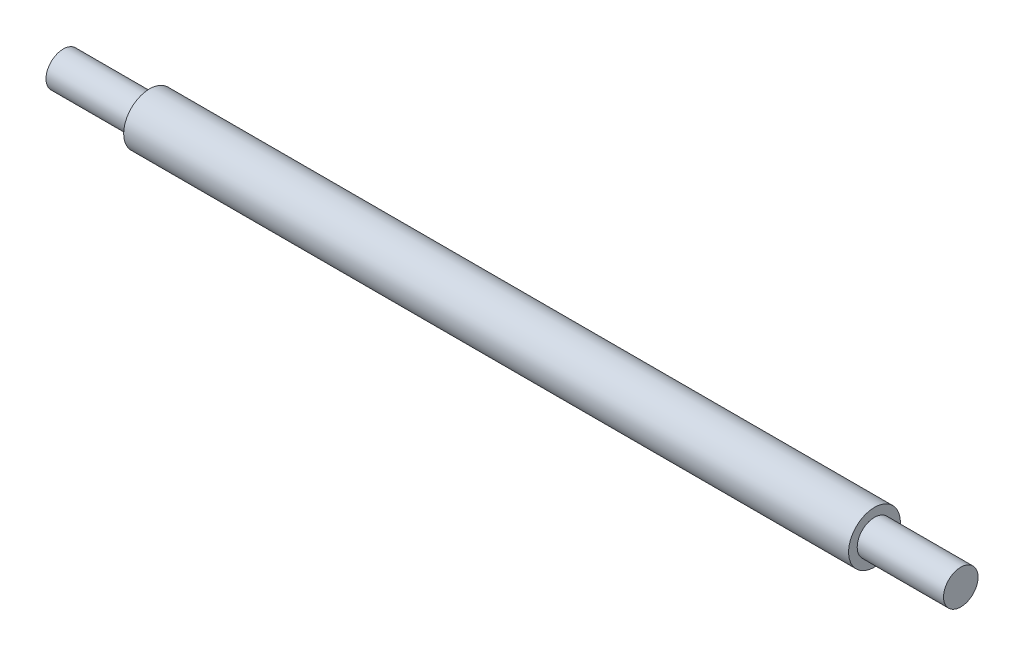
ISO-10303-21;
HEADER;
FILE_DESCRIPTION(('STEP AP214'),'2;1');
FILE_NAME('part.step','',(''),(''),'','','');
FILE_SCHEMA(('AUTOMOTIVE_DESIGN { 1 0 10303 214 1 1 1 1 }'));
ENDSEC;
DATA;
#1=APPLICATION_CONTEXT('core data for automotive mechanical design processes');
#2=APPLICATION_PROTOCOL_DEFINITION('international standard','automotive_design',2000,#1);
#3=PRODUCT_CONTEXT('',#1,'mechanical');
#4=PRODUCT('Part','Part','',(#3));
#5=PRODUCT_RELATED_PRODUCT_CATEGORY('part','',(#4));
#6=PRODUCT_DEFINITION_FORMATION('','',#4);
#7=PRODUCT_DEFINITION_CONTEXT('part definition',#1,'design');
#8=PRODUCT_DEFINITION('design','',#6,#7);
#9=PRODUCT_DEFINITION_SHAPE('','',#8);
#10=(LENGTH_UNIT() NAMED_UNIT(*) SI_UNIT(.MILLI.,.METRE.));
#11=(NAMED_UNIT(*) PLANE_ANGLE_UNIT() SI_UNIT($,.RADIAN.));
#12=(NAMED_UNIT(*) SI_UNIT($,.STERADIAN.) SOLID_ANGLE_UNIT());
#13=UNCERTAINTY_MEASURE_WITH_UNIT(LENGTH_MEASURE(1.E-05),#10,'distance_accuracy_value','');
#14=(GEOMETRIC_REPRESENTATION_CONTEXT(3) GLOBAL_UNCERTAINTY_ASSIGNED_CONTEXT((#13)) GLOBAL_UNIT_ASSIGNED_CONTEXT((#10,
#11,#12)) REPRESENTATION_CONTEXT('',''));
#15=CARTESIAN_POINT('',(0.,0.,0.));
#16=DIRECTION('',(0.,0.,1.));
#17=DIRECTION('',(1.,0.,0.));
#18=AXIS2_PLACEMENT_3D('',#15,#16,#17);
#19=CARTESIAN_POINT('',(-52.,0.,0.));
#20=DIRECTION('',(-1.,0.,0.));
#21=DIRECTION('',(0.,0.,1.));
#22=AXIS2_PLACEMENT_3D('',#19,#20,#21);
#23=CYLINDRICAL_SURFACE('',#22,2.);
#24=CARTESIAN_POINT('',(42.,0.,0.));
#25=DIRECTION('',(-1.,0.,0.));
#26=DIRECTION('',(0.,0.,1.));
#27=AXIS2_PLACEMENT_3D('',#24,#25,#26);
#28=CIRCLE('',#27,2.);
#29=CARTESIAN_POINT('',(42.,0.,2.));
#30=VERTEX_POINT('',#29);
#31=EDGE_CURVE('E53',#30,#30,#28,.T.);
#32=ORIENTED_EDGE('',*,*,#31,.F.);
#33=EDGE_LOOP('',(#32));
#34=FACE_BOUND('',#33,.T.);
#35=CARTESIAN_POINT('',(52.,0.,0.));
#36=DIRECTION('',(-1.,0.,0.));
#37=DIRECTION('',(0.,0.,1.));
#38=AXIS2_PLACEMENT_3D('',#35,#36,#37);
#39=CIRCLE('',#38,2.);
#40=CARTESIAN_POINT('',(52.,0.,2.));
#41=VERTEX_POINT('',#40);
#42=EDGE_CURVE('E10',#41,#41,#39,.T.);
#43=ORIENTED_EDGE('',*,*,#42,.T.);
#44=EDGE_LOOP('',(#43));
#45=FACE_BOUND('',#44,.T.);
#46=ADVANCED_FACE('F31',(#34,#45),#23,.T.);
#47=CARTESIAN_POINT('',(52.,0.,0.));
#48=DIRECTION('',(-1.,0.,0.));
#49=DIRECTION('',(0.,0.,1.));
#50=AXIS2_PLACEMENT_3D('',#47,#48,#49);
#51=PLANE('',#50);
#52=ORIENTED_EDGE('',*,*,#42,.F.);
#53=EDGE_LOOP('',(#52));
#54=FACE_BOUND('',#53,.T.);
#55=ADVANCED_FACE('F60',(#54),#51,.F.);
#56=CARTESIAN_POINT('',(-52.,0.,0.));
#57=DIRECTION('',(1.,0.,0.));
#58=DIRECTION('',(0.,0.,-1.));
#59=AXIS2_PLACEMENT_3D('',#56,#57,#58);
#60=PLANE('',#59);
#61=CARTESIAN_POINT('',(-52.,0.,0.));
#62=DIRECTION('',(-1.,0.,0.));
#63=DIRECTION('',(0.,0.,1.));
#64=AXIS2_PLACEMENT_3D('',#61,#62,#63);
#65=CIRCLE('',#64,2.);
#66=CARTESIAN_POINT('',(-52.,0.,2.));
#67=VERTEX_POINT('',#66);
#68=EDGE_CURVE('E37',#67,#67,#65,.T.);
#69=ORIENTED_EDGE('',*,*,#68,.T.);
#70=EDGE_LOOP('',(#69));
#71=FACE_BOUND('',#70,.T.);
#72=ADVANCED_FACE('F64',(#71),#60,.F.);
#73=CARTESIAN_POINT('',(-52.,0.,0.));
#74=DIRECTION('',(-1.,0.,0.));
#75=DIRECTION('',(0.,0.,1.));
#76=AXIS2_PLACEMENT_3D('',#73,#74,#75);
#77=CYLINDRICAL_SURFACE('',#76,2.);
#78=ORIENTED_EDGE('',*,*,#68,.F.);
#79=EDGE_LOOP('',(#78));
#80=FACE_BOUND('',#79,.T.);
#81=CARTESIAN_POINT('',(-42.,0.,0.));
#82=DIRECTION('',(-1.,0.,0.));
#83=DIRECTION('',(0.,0.,1.));
#84=AXIS2_PLACEMENT_3D('',#81,#82,#83);
#85=CIRCLE('',#84,2.);
#86=CARTESIAN_POINT('',(-42.,0.,2.));
#87=VERTEX_POINT('',#86);
#88=EDGE_CURVE('E41',#87,#87,#85,.T.);
#89=ORIENTED_EDGE('',*,*,#88,.T.);
#90=EDGE_LOOP('',(#89));
#91=FACE_BOUND('',#90,.T.);
#92=ADVANCED_FACE('F69',(#80,#91),#77,.T.);
#93=CARTESIAN_POINT('',(-42.,2.,0.));
#94=DIRECTION('',(1.,0.,0.));
#95=DIRECTION('',(0.,0.,-1.));
#96=AXIS2_PLACEMENT_3D('',#93,#94,#95);
#97=PLANE('',#96);
#98=ORIENTED_EDGE('',*,*,#88,.F.);
#99=EDGE_LOOP('',(#98));
#100=FACE_BOUND('',#99,.T.);
#101=CARTESIAN_POINT('',(-42.,0.,0.));
#102=DIRECTION('',(-1.,0.,0.));
#103=DIRECTION('',(0.,0.,1.));
#104=AXIS2_PLACEMENT_3D('',#101,#102,#103);
#105=CIRCLE('',#104,3.);
#106=CARTESIAN_POINT('',(-42.,0.,3.));
#107=VERTEX_POINT('',#106);
#108=EDGE_CURVE('E45',#107,#107,#105,.T.);
#109=ORIENTED_EDGE('',*,*,#108,.T.);
#110=EDGE_LOOP('',(#109));
#111=FACE_BOUND('',#110,.T.);
#112=ADVANCED_FACE('F74',(#100,#111),#97,.F.);
#113=CARTESIAN_POINT('',(-52.,0.,0.));
#114=DIRECTION('',(-1.,0.,0.));
#115=DIRECTION('',(0.,0.,1.));
#116=AXIS2_PLACEMENT_3D('',#113,#114,#115);
#117=CYLINDRICAL_SURFACE('',#116,3.);
#118=ORIENTED_EDGE('',*,*,#108,.F.);
#119=EDGE_LOOP('',(#118));
#120=FACE_BOUND('',#119,.T.);
#121=CARTESIAN_POINT('',(42.,0.,0.));
#122=DIRECTION('',(-1.,0.,0.));
#123=DIRECTION('',(0.,0.,1.));
#124=AXIS2_PLACEMENT_3D('',#121,#122,#123);
#125=CIRCLE('',#124,3.);
#126=CARTESIAN_POINT('',(42.,0.,3.));
#127=VERTEX_POINT('',#126);
#128=EDGE_CURVE('E50',#127,#127,#125,.T.);
#129=ORIENTED_EDGE('',*,*,#128,.T.);
#130=EDGE_LOOP('',(#129));
#131=FACE_BOUND('',#130,.T.);
#132=ADVANCED_FACE('F78',(#120,#131),#117,.T.);
#133=CARTESIAN_POINT('',(42.,2.,0.));
#134=DIRECTION('',(-1.,0.,0.));
#135=DIRECTION('',(0.,0.,1.));
#136=AXIS2_PLACEMENT_3D('',#133,#134,#135);
#137=PLANE('',#136);
#138=ORIENTED_EDGE('',*,*,#128,.F.);
#139=EDGE_LOOP('',(#138));
#140=FACE_BOUND('',#139,.T.);
#141=ORIENTED_EDGE('',*,*,#31,.T.);
#142=EDGE_LOOP('',(#141));
#143=FACE_BOUND('',#142,.T.);
#144=ADVANCED_FACE('F57',(#140,#143),#137,.F.);
#145=CLOSED_SHELL('',(#46,#55,#72,#92,#112,#132,#144));
#146=MANIFOLD_SOLID_BREP('B2',#145);
#147=ADVANCED_BREP_SHAPE_REPRESENTATION('',(#18,#146),#14);
#148=SHAPE_DEFINITION_REPRESENTATION(#9,#147);
ENDSEC;
END-ISO-10303-21;
